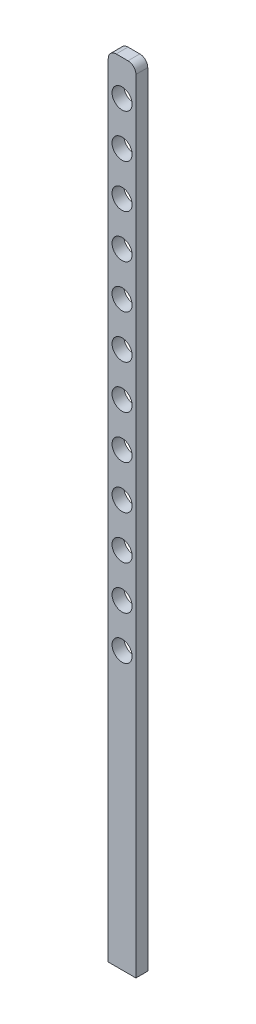
ISO-10303-21;
HEADER;
FILE_DESCRIPTION(('STEP AP214'),'2;1');
FILE_NAME('part.step','',(''),(''),'','','');
FILE_SCHEMA(('AUTOMOTIVE_DESIGN { 1 0 10303 214 1 1 1 1 }'));
ENDSEC;
DATA;
#1=APPLICATION_CONTEXT('core data for automotive mechanical design processes');
#2=APPLICATION_PROTOCOL_DEFINITION('international standard','automotive_design',2000,#1);
#3=PRODUCT_CONTEXT('',#1,'mechanical');
#4=PRODUCT('Part','Part','',(#3));
#5=PRODUCT_RELATED_PRODUCT_CATEGORY('part','',(#4));
#6=PRODUCT_DEFINITION_FORMATION('','',#4);
#7=PRODUCT_DEFINITION_CONTEXT('part definition',#1,'design');
#8=PRODUCT_DEFINITION('design','',#6,#7);
#9=PRODUCT_DEFINITION_SHAPE('','',#8);
#10=(LENGTH_UNIT() NAMED_UNIT(*) SI_UNIT(.MILLI.,.METRE.));
#11=(NAMED_UNIT(*) PLANE_ANGLE_UNIT() SI_UNIT($,.RADIAN.));
#12=(NAMED_UNIT(*) SI_UNIT($,.STERADIAN.) SOLID_ANGLE_UNIT());
#13=UNCERTAINTY_MEASURE_WITH_UNIT(LENGTH_MEASURE(1.E-05),#10,'distance_accuracy_value','');
#14=(GEOMETRIC_REPRESENTATION_CONTEXT(3) GLOBAL_UNCERTAINTY_ASSIGNED_CONTEXT((#13)) GLOBAL_UNIT_ASSIGNED_CONTEXT((#10,
#11,#12)) REPRESENTATION_CONTEXT('',''));
#15=CARTESIAN_POINT('',(0.,0.,0.));
#16=DIRECTION('',(0.,0.,1.));
#17=DIRECTION('',(1.,0.,0.));
#18=AXIS2_PLACEMENT_3D('',#15,#16,#17);
#19=CARTESIAN_POINT('',(0.,455.,-7.5));
#20=DIRECTION('',(0.,0.,1.));
#21=DIRECTION('',(1.,0.,0.));
#22=AXIS2_PLACEMENT_3D('',#19,#20,#21);
#23=CYLINDRICAL_SURFACE('',#22,12.7);
#24=CARTESIAN_POINT('',(0.,455.,-7.5));
#25=DIRECTION('',(0.,0.,1.));
#26=DIRECTION('',(1.,0.,0.));
#27=AXIS2_PLACEMENT_3D('',#24,#25,#26);
#28=CIRCLE('',#27,12.7);
#29=CARTESIAN_POINT('',(12.6999999999999,455.,-7.5));
#30=VERTEX_POINT('',#29);
#31=EDGE_CURVE('E215',#30,#30,#28,.T.);
#32=ORIENTED_EDGE('',*,*,#31,.F.);
#33=EDGE_LOOP('',(#32));
#34=FACE_BOUND('',#33,.T.);
#35=CARTESIAN_POINT('',(0.,455.,7.5));
#36=DIRECTION('',(0.,0.,1.));
#37=DIRECTION('',(1.,0.,0.));
#38=AXIS2_PLACEMENT_3D('',#35,#36,#37);
#39=CIRCLE('',#38,12.7);
#40=CARTESIAN_POINT('',(12.6999999999999,455.,7.5));
#41=VERTEX_POINT('',#40);
#42=EDGE_CURVE('E219',#41,#41,#39,.T.);
#43=ORIENTED_EDGE('',*,*,#42,.T.);
#44=EDGE_LOOP('',(#43));
#45=FACE_BOUND('',#44,.T.);
#46=ADVANCED_FACE('F45',(#34,#45),#23,.F.);
#47=CARTESIAN_POINT('',(0.,400.,-7.5));
#48=DIRECTION('',(0.,0.,1.));
#49=DIRECTION('',(1.,0.,0.));
#50=AXIS2_PLACEMENT_3D('',#47,#48,#49);
#51=CYLINDRICAL_SURFACE('',#50,12.7);
#52=CARTESIAN_POINT('',(0.,400.,-7.5));
#53=DIRECTION('',(0.,0.,1.));
#54=DIRECTION('',(1.,0.,0.));
#55=AXIS2_PLACEMENT_3D('',#52,#53,#54);
#56=CIRCLE('',#55,12.7);
#57=CARTESIAN_POINT('',(12.6999999999999,400.,-7.5));
#58=VERTEX_POINT('',#57);
#59=EDGE_CURVE('E207',#58,#58,#56,.T.);
#60=ORIENTED_EDGE('',*,*,#59,.F.);
#61=EDGE_LOOP('',(#60));
#62=FACE_BOUND('',#61,.T.);
#63=CARTESIAN_POINT('',(0.,400.,7.5));
#64=DIRECTION('',(0.,0.,1.));
#65=DIRECTION('',(1.,0.,0.));
#66=AXIS2_PLACEMENT_3D('',#63,#64,#65);
#67=CIRCLE('',#66,12.7);
#68=CARTESIAN_POINT('',(12.6999999999999,400.,7.5));
#69=VERTEX_POINT('',#68);
#70=EDGE_CURVE('E211',#69,#69,#67,.T.);
#71=ORIENTED_EDGE('',*,*,#70,.T.);
#72=EDGE_LOOP('',(#71));
#73=FACE_BOUND('',#72,.T.);
#74=ADVANCED_FACE('F297',(#62,#73),#51,.F.);
#75=CARTESIAN_POINT('',(0.,345.,-7.5));
#76=DIRECTION('',(0.,0.,1.));
#77=DIRECTION('',(1.,0.,0.));
#78=AXIS2_PLACEMENT_3D('',#75,#76,#77);
#79=CYLINDRICAL_SURFACE('',#78,12.7);
#80=CARTESIAN_POINT('',(0.,345.,-7.5));
#81=DIRECTION('',(0.,0.,1.));
#82=DIRECTION('',(1.,0.,0.));
#83=AXIS2_PLACEMENT_3D('',#80,#81,#82);
#84=CIRCLE('',#83,12.7);
#85=CARTESIAN_POINT('',(12.6999999999999,345.,-7.5));
#86=VERTEX_POINT('',#85);
#87=EDGE_CURVE('E199',#86,#86,#84,.T.);
#88=ORIENTED_EDGE('',*,*,#87,.F.);
#89=EDGE_LOOP('',(#88));
#90=FACE_BOUND('',#89,.T.);
#91=CARTESIAN_POINT('',(0.,345.,7.5));
#92=DIRECTION('',(0.,0.,1.));
#93=DIRECTION('',(1.,0.,0.));
#94=AXIS2_PLACEMENT_3D('',#91,#92,#93);
#95=CIRCLE('',#94,12.7);
#96=CARTESIAN_POINT('',(12.6999999999999,345.,7.5));
#97=VERTEX_POINT('',#96);
#98=EDGE_CURVE('E203',#97,#97,#95,.T.);
#99=ORIENTED_EDGE('',*,*,#98,.T.);
#100=EDGE_LOOP('',(#99));
#101=FACE_BOUND('',#100,.T.);
#102=ADVANCED_FACE('F303',(#90,#101),#79,.F.);
#103=CARTESIAN_POINT('',(0.,290.,-7.5));
#104=DIRECTION('',(0.,0.,1.));
#105=DIRECTION('',(1.,0.,0.));
#106=AXIS2_PLACEMENT_3D('',#103,#104,#105);
#107=CYLINDRICAL_SURFACE('',#106,12.7);
#108=CARTESIAN_POINT('',(0.,290.,-7.5));
#109=DIRECTION('',(0.,0.,1.));
#110=DIRECTION('',(1.,0.,0.));
#111=AXIS2_PLACEMENT_3D('',#108,#109,#110);
#112=CIRCLE('',#111,12.7);
#113=CARTESIAN_POINT('',(12.6999999999999,290.,-7.5));
#114=VERTEX_POINT('',#113);
#115=EDGE_CURVE('E191',#114,#114,#112,.T.);
#116=ORIENTED_EDGE('',*,*,#115,.F.);
#117=EDGE_LOOP('',(#116));
#118=FACE_BOUND('',#117,.T.);
#119=CARTESIAN_POINT('',(0.,290.,7.5));
#120=DIRECTION('',(0.,0.,1.));
#121=DIRECTION('',(1.,0.,0.));
#122=AXIS2_PLACEMENT_3D('',#119,#120,#121);
#123=CIRCLE('',#122,12.7);
#124=CARTESIAN_POINT('',(12.6999999999999,290.,7.5));
#125=VERTEX_POINT('',#124);
#126=EDGE_CURVE('E195',#125,#125,#123,.T.);
#127=ORIENTED_EDGE('',*,*,#126,.T.);
#128=EDGE_LOOP('',(#127));
#129=FACE_BOUND('',#128,.T.);
#130=ADVANCED_FACE('F435',(#118,#129),#107,.F.);
#131=CARTESIAN_POINT('',(0.,235.,-7.5));
#132=DIRECTION('',(0.,0.,1.));
#133=DIRECTION('',(1.,0.,0.));
#134=AXIS2_PLACEMENT_3D('',#131,#132,#133);
#135=CYLINDRICAL_SURFACE('',#134,12.7);
#136=CARTESIAN_POINT('',(0.,235.,-7.5));
#137=DIRECTION('',(0.,0.,1.));
#138=DIRECTION('',(1.,0.,0.));
#139=AXIS2_PLACEMENT_3D('',#136,#137,#138);
#140=CIRCLE('',#139,12.7);
#141=CARTESIAN_POINT('',(12.6999999999999,235.,-7.5));
#142=VERTEX_POINT('',#141);
#143=EDGE_CURVE('E183',#142,#142,#140,.T.);
#144=ORIENTED_EDGE('',*,*,#143,.F.);
#145=EDGE_LOOP('',(#144));
#146=FACE_BOUND('',#145,.T.);
#147=CARTESIAN_POINT('',(0.,235.,7.5));
#148=DIRECTION('',(0.,0.,1.));
#149=DIRECTION('',(1.,0.,0.));
#150=AXIS2_PLACEMENT_3D('',#147,#148,#149);
#151=CIRCLE('',#150,12.7);
#152=CARTESIAN_POINT('',(12.6999999999999,235.,7.5));
#153=VERTEX_POINT('',#152);
#154=EDGE_CURVE('E187',#153,#153,#151,.T.);
#155=ORIENTED_EDGE('',*,*,#154,.T.);
#156=EDGE_LOOP('',(#155));
#157=FACE_BOUND('',#156,.T.);
#158=ADVANCED_FACE('F425',(#146,#157),#135,.F.);
#159=CARTESIAN_POINT('',(0.,180.,-7.5));
#160=DIRECTION('',(0.,0.,1.));
#161=DIRECTION('',(1.,0.,0.));
#162=AXIS2_PLACEMENT_3D('',#159,#160,#161);
#163=CYLINDRICAL_SURFACE('',#162,12.7);
#164=CARTESIAN_POINT('',(0.,180.,-7.5));
#165=DIRECTION('',(0.,0.,1.));
#166=DIRECTION('',(1.,0.,0.));
#167=AXIS2_PLACEMENT_3D('',#164,#165,#166);
#168=CIRCLE('',#167,12.7);
#169=CARTESIAN_POINT('',(12.7,180.,-7.5));
#170=VERTEX_POINT('',#169);
#171=EDGE_CURVE('E175',#170,#170,#168,.T.);
#172=ORIENTED_EDGE('',*,*,#171,.F.);
#173=EDGE_LOOP('',(#172));
#174=FACE_BOUND('',#173,.T.);
#175=CARTESIAN_POINT('',(0.,180.,7.5));
#176=DIRECTION('',(0.,0.,1.));
#177=DIRECTION('',(1.,0.,0.));
#178=AXIS2_PLACEMENT_3D('',#175,#176,#177);
#179=CIRCLE('',#178,12.7);
#180=CARTESIAN_POINT('',(12.7,180.,7.5));
#181=VERTEX_POINT('',#180);
#182=EDGE_CURVE('E179',#181,#181,#179,.T.);
#183=ORIENTED_EDGE('',*,*,#182,.T.);
#184=EDGE_LOOP('',(#183));
#185=FACE_BOUND('',#184,.T.);
#186=ADVANCED_FACE('F415',(#174,#185),#163,.F.);
#187=CARTESIAN_POINT('',(0.,125.,-7.5));
#188=DIRECTION('',(0.,0.,1.));
#189=DIRECTION('',(1.,0.,0.));
#190=AXIS2_PLACEMENT_3D('',#187,#188,#189);
#191=CYLINDRICAL_SURFACE('',#190,12.7);
#192=CARTESIAN_POINT('',(0.,125.,-7.5));
#193=DIRECTION('',(0.,0.,1.));
#194=DIRECTION('',(1.,0.,0.));
#195=AXIS2_PLACEMENT_3D('',#192,#193,#194);
#196=CIRCLE('',#195,12.7);
#197=CARTESIAN_POINT('',(12.7,125.,-7.5));
#198=VERTEX_POINT('',#197);
#199=EDGE_CURVE('E167',#198,#198,#196,.T.);
#200=ORIENTED_EDGE('',*,*,#199,.F.);
#201=EDGE_LOOP('',(#200));
#202=FACE_BOUND('',#201,.T.);
#203=CARTESIAN_POINT('',(0.,125.,7.5));
#204=DIRECTION('',(0.,0.,1.));
#205=DIRECTION('',(1.,0.,0.));
#206=AXIS2_PLACEMENT_3D('',#203,#204,#205);
#207=CIRCLE('',#206,12.7);
#208=CARTESIAN_POINT('',(12.7,125.,7.5));
#209=VERTEX_POINT('',#208);
#210=EDGE_CURVE('E171',#209,#209,#207,.T.);
#211=ORIENTED_EDGE('',*,*,#210,.T.);
#212=EDGE_LOOP('',(#211));
#213=FACE_BOUND('',#212,.T.);
#214=ADVANCED_FACE('F405',(#202,#213),#191,.F.);
#215=CARTESIAN_POINT('',(0.,70.,-7.5));
#216=DIRECTION('',(0.,0.,1.));
#217=DIRECTION('',(1.,0.,0.));
#218=AXIS2_PLACEMENT_3D('',#215,#216,#217);
#219=CYLINDRICAL_SURFACE('',#218,12.7);
#220=CARTESIAN_POINT('',(0.,70.,-7.5));
#221=DIRECTION('',(0.,0.,1.));
#222=DIRECTION('',(1.,0.,0.));
#223=AXIS2_PLACEMENT_3D('',#220,#221,#222);
#224=CIRCLE('',#223,12.7);
#225=CARTESIAN_POINT('',(12.7,70.,-7.5));
#226=VERTEX_POINT('',#225);
#227=EDGE_CURVE('E159',#226,#226,#224,.T.);
#228=ORIENTED_EDGE('',*,*,#227,.F.);
#229=EDGE_LOOP('',(#228));
#230=FACE_BOUND('',#229,.T.);
#231=CARTESIAN_POINT('',(0.,70.,7.5));
#232=DIRECTION('',(0.,0.,1.));
#233=DIRECTION('',(1.,0.,0.));
#234=AXIS2_PLACEMENT_3D('',#231,#232,#233);
#235=CIRCLE('',#234,12.7);
#236=CARTESIAN_POINT('',(12.7,70.,7.5));
#237=VERTEX_POINT('',#236);
#238=EDGE_CURVE('E163',#237,#237,#235,.T.);
#239=ORIENTED_EDGE('',*,*,#238,.T.);
#240=EDGE_LOOP('',(#239));
#241=FACE_BOUND('',#240,.T.);
#242=ADVANCED_FACE('F395',(#230,#241),#219,.F.);
#243=CARTESIAN_POINT('',(0.,15.,-7.5));
#244=DIRECTION('',(0.,0.,1.));
#245=DIRECTION('',(1.,0.,0.));
#246=AXIS2_PLACEMENT_3D('',#243,#244,#245);
#247=CYLINDRICAL_SURFACE('',#246,12.7);
#248=CARTESIAN_POINT('',(0.,15.,-7.5));
#249=DIRECTION('',(0.,0.,1.));
#250=DIRECTION('',(1.,0.,0.));
#251=AXIS2_PLACEMENT_3D('',#248,#249,#250);
#252=CIRCLE('',#251,12.7);
#253=CARTESIAN_POINT('',(12.7,15.,-7.5));
#254=VERTEX_POINT('',#253);
#255=EDGE_CURVE('E151',#254,#254,#252,.T.);
#256=ORIENTED_EDGE('',*,*,#255,.F.);
#257=EDGE_LOOP('',(#256));
#258=FACE_BOUND('',#257,.T.);
#259=CARTESIAN_POINT('',(0.,15.,7.5));
#260=DIRECTION('',(0.,0.,1.));
#261=DIRECTION('',(1.,0.,0.));
#262=AXIS2_PLACEMENT_3D('',#259,#260,#261);
#263=CIRCLE('',#262,12.7);
#264=CARTESIAN_POINT('',(12.7,15.,7.5));
#265=VERTEX_POINT('',#264);
#266=EDGE_CURVE('E155',#265,#265,#263,.T.);
#267=ORIENTED_EDGE('',*,*,#266,.T.);
#268=EDGE_LOOP('',(#267));
#269=FACE_BOUND('',#268,.T.);
#270=ADVANCED_FACE('F385',(#258,#269),#247,.F.);
#271=CARTESIAN_POINT('',(0.,-40.,-7.5));
#272=DIRECTION('',(0.,0.,1.));
#273=DIRECTION('',(1.,0.,0.));
#274=AXIS2_PLACEMENT_3D('',#271,#272,#273);
#275=CYLINDRICAL_SURFACE('',#274,12.7);
#276=CARTESIAN_POINT('',(0.,-40.,-7.5));
#277=DIRECTION('',(0.,0.,1.));
#278=DIRECTION('',(1.,0.,0.));
#279=AXIS2_PLACEMENT_3D('',#276,#277,#278);
#280=CIRCLE('',#279,12.7);
#281=CARTESIAN_POINT('',(12.7,-40.,-7.5));
#282=VERTEX_POINT('',#281);
#283=EDGE_CURVE('E119',#282,#282,#280,.T.);
#284=ORIENTED_EDGE('',*,*,#283,.F.);
#285=EDGE_LOOP('',(#284));
#286=FACE_BOUND('',#285,.T.);
#287=CARTESIAN_POINT('',(0.,-40.,7.5));
#288=DIRECTION('',(0.,0.,1.));
#289=DIRECTION('',(1.,0.,0.));
#290=AXIS2_PLACEMENT_3D('',#287,#288,#289);
#291=CIRCLE('',#290,12.7);
#292=CARTESIAN_POINT('',(12.7,-40.,7.5));
#293=VERTEX_POINT('',#292);
#294=EDGE_CURVE('E147',#293,#293,#291,.T.);
#295=ORIENTED_EDGE('',*,*,#294,.T.);
#296=EDGE_LOOP('',(#295));
#297=FACE_BOUND('',#296,.T.);
#298=ADVANCED_FACE('F377',(#286,#297),#275,.F.);
#299=CARTESIAN_POINT('',(17.4999999999999,500.,7.5));
#300=DIRECTION('',(-1.,0.,0.));
#301=DIRECTION('',(0.,-1.,0.));
#302=AXIS2_PLACEMENT_3D('',#299,#300,#301);
#303=PLANE('',#302);
#304=DIRECTION('',(0.,1.,0.));
#305=VECTOR('',#304,1.);
#306=CARTESIAN_POINT('',(17.4999999999999,500.,-7.5));
#307=LINE('',#306,#305);
#308=CARTESIAN_POINT('',(17.5000000000001,-500.,-7.5));
#309=VERTEX_POINT('',#308);
#310=CARTESIAN_POINT('',(17.4999999999999,490.,-7.5));
#311=VERTEX_POINT('',#310);
#312=EDGE_CURVE('E130',#309,#311,#307,.T.);
#313=ORIENTED_EDGE('',*,*,#312,.T.);
#314=DIRECTION('',(0.,0.,-1.));
#315=VECTOR('',#314,1.);
#316=CARTESIAN_POINT('',(17.4999999999999,490.,7.5));
#317=LINE('',#316,#315);
#318=CARTESIAN_POINT('',(17.4999999999999,490.,7.5));
#319=VERTEX_POINT('',#318);
#320=EDGE_CURVE('E69',#311,#319,#317,.F.);
#321=ORIENTED_EDGE('',*,*,#320,.T.);
#322=DIRECTION('',(0.,1.,0.));
#323=VECTOR('',#322,1.);
#324=CARTESIAN_POINT('',(17.4999999999999,500.,7.5));
#325=LINE('',#324,#323);
#326=CARTESIAN_POINT('',(17.5000000000001,-500.,7.5));
#327=VERTEX_POINT('',#326);
#328=EDGE_CURVE('E142',#327,#319,#325,.T.);
#329=ORIENTED_EDGE('',*,*,#328,.F.);
#330=DIRECTION('',(0.,0.,-1.));
#331=VECTOR('',#330,1.);
#332=CARTESIAN_POINT('',(17.5000000000001,-500.,7.5));
#333=LINE('',#332,#331);
#334=EDGE_CURVE('E120',#327,#309,#333,.T.);
#335=ORIENTED_EDGE('',*,*,#334,.T.);
#336=EDGE_LOOP('',(#313,#321,#329,#335));
#337=FACE_BOUND('',#336,.T.);
#338=ADVANCED_FACE('F254',(#337),#303,.F.);
#339=CARTESIAN_POINT('',(-17.5000000000001,500.,7.5));
#340=DIRECTION('',(0.,-1.,0.));
#341=DIRECTION('',(0.,0.,-1.));
#342=AXIS2_PLACEMENT_3D('',#339,#340,#341);
#343=PLANE('',#342);
#344=DIRECTION('',(-1.,0.,0.));
#345=VECTOR('',#344,1.);
#346=CARTESIAN_POINT('',(-17.5000000000001,500.,7.5));
#347=LINE('',#346,#345);
#348=CARTESIAN_POINT('',(7.49999999999994,500.,7.5));
#349=VERTEX_POINT('',#348);
#350=CARTESIAN_POINT('',(-7.50000000000006,500.,7.5));
#351=VERTEX_POINT('',#350);
#352=EDGE_CURVE('E109',#349,#351,#347,.T.);
#353=ORIENTED_EDGE('',*,*,#352,.F.);
#354=DIRECTION('',(0.,0.,-1.));
#355=VECTOR('',#354,1.);
#356=CARTESIAN_POINT('',(7.49999999999994,500.,7.5));
#357=LINE('',#356,#355);
#358=CARTESIAN_POINT('',(7.49999999999994,500.,-7.5));
#359=VERTEX_POINT('',#358);
#360=EDGE_CURVE('E226',#349,#359,#357,.T.);
#361=ORIENTED_EDGE('',*,*,#360,.T.);
#362=DIRECTION('',(-1.,0.,0.));
#363=VECTOR('',#362,1.);
#364=CARTESIAN_POINT('',(-17.5000000000001,500.,-7.5));
#365=LINE('',#364,#363);
#366=CARTESIAN_POINT('',(-7.50000000000006,500.,-7.5));
#367=VERTEX_POINT('',#366);
#368=EDGE_CURVE('E133',#359,#367,#365,.T.);
#369=ORIENTED_EDGE('',*,*,#368,.T.);
#370=DIRECTION('',(0.,0.,-1.));
#371=VECTOR('',#370,1.);
#372=CARTESIAN_POINT('',(-7.50000000000006,500.,7.5));
#373=LINE('',#372,#371);
#374=EDGE_CURVE('E223',#367,#351,#373,.F.);
#375=ORIENTED_EDGE('',*,*,#374,.T.);
#376=EDGE_LOOP('',(#353,#361,#369,#375));
#377=FACE_BOUND('',#376,.T.);
#378=ADVANCED_FACE('F245',(#377),#343,.F.);
#379=CARTESIAN_POINT('',(-17.5000000000001,500.,7.5));
#380=DIRECTION('',(1.,0.,0.));
#381=DIRECTION('',(0.,1.,0.));
#382=AXIS2_PLACEMENT_3D('',#379,#380,#381);
#383=PLANE('',#382);
#384=DIRECTION('',(0.,-1.,0.));
#385=VECTOR('',#384,1.);
#386=CARTESIAN_POINT('',(-17.5000000000001,500.,7.5));
#387=LINE('',#386,#385);
#388=CARTESIAN_POINT('',(-17.5000000000001,490.,7.5));
#389=VERTEX_POINT('',#388);
#390=CARTESIAN_POINT('',(-17.4999999999999,-500.,7.5));
#391=VERTEX_POINT('',#390);
#392=EDGE_CURVE('E99',#389,#391,#387,.T.);
#393=ORIENTED_EDGE('',*,*,#392,.F.);
#394=DIRECTION('',(0.,0.,-1.));
#395=VECTOR('',#394,1.);
#396=CARTESIAN_POINT('',(-17.5000000000001,490.,7.5));
#397=LINE('',#396,#395);
#398=CARTESIAN_POINT('',(-17.5000000000001,490.,-7.5));
#399=VERTEX_POINT('',#398);
#400=EDGE_CURVE('E11',#389,#399,#397,.T.);
#401=ORIENTED_EDGE('',*,*,#400,.T.);
#402=DIRECTION('',(0.,-1.,0.));
#403=VECTOR('',#402,1.);
#404=CARTESIAN_POINT('',(-17.5000000000001,500.,-7.5));
#405=LINE('',#404,#403);
#406=CARTESIAN_POINT('',(-17.4999999999999,-500.,-7.5));
#407=VERTEX_POINT('',#406);
#408=EDGE_CURVE('E115',#399,#407,#405,.T.);
#409=ORIENTED_EDGE('',*,*,#408,.T.);
#410=DIRECTION('',(0.,0.,-1.));
#411=VECTOR('',#410,1.);
#412=CARTESIAN_POINT('',(-17.4999999999999,-500.,7.5));
#413=LINE('',#412,#411);
#414=EDGE_CURVE('E112',#391,#407,#413,.T.);
#415=ORIENTED_EDGE('',*,*,#414,.F.);
#416=EDGE_LOOP('',(#393,#401,#409,#415));
#417=FACE_BOUND('',#416,.T.);
#418=ADVANCED_FACE('F113',(#417),#383,.F.);
#419=CARTESIAN_POINT('',(-17.4999999999999,-500.,7.5));
#420=DIRECTION('',(0.,1.,0.));
#421=DIRECTION('',(0.,0.,1.));
#422=AXIS2_PLACEMENT_3D('',#419,#420,#421);
#423=PLANE('',#422);
#424=DIRECTION('',(1.,0.,0.));
#425=VECTOR('',#424,1.);
#426=CARTESIAN_POINT('',(-17.4999999999999,-500.,-7.5));
#427=LINE('',#426,#425);
#428=EDGE_CURVE('E140',#407,#309,#427,.T.);
#429=ORIENTED_EDGE('',*,*,#428,.T.);
#430=ORIENTED_EDGE('',*,*,#334,.F.);
#431=DIRECTION('',(1.,0.,0.));
#432=VECTOR('',#431,1.);
#433=CARTESIAN_POINT('',(-17.4999999999999,-500.,7.5));
#434=LINE('',#433,#432);
#435=EDGE_CURVE('E104',#391,#327,#434,.T.);
#436=ORIENTED_EDGE('',*,*,#435,.F.);
#437=ORIENTED_EDGE('',*,*,#414,.T.);
#438=EDGE_LOOP('',(#429,#430,#436,#437));
#439=FACE_BOUND('',#438,.T.);
#440=ADVANCED_FACE('F122',(#439),#423,.F.);
#441=CARTESIAN_POINT('',(0.,0.,7.5));
#442=DIRECTION('',(0.,0.,1.));
#443=DIRECTION('',(1.,0.,0.));
#444=AXIS2_PLACEMENT_3D('',#441,#442,#443);
#445=PLANE('',#444);
#446=CARTESIAN_POINT('',(0.,-95.,7.5));
#447=DIRECTION('',(0.,0.,1.));
#448=DIRECTION('',(1.,0.,0.));
#449=AXIS2_PLACEMENT_3D('',#446,#447,#448);
#450=CIRCLE('',#449,12.7);
#451=CARTESIAN_POINT('',(12.7,-95.,7.5));
#452=VERTEX_POINT('',#451);
#453=EDGE_CURVE('E265',#452,#452,#450,.T.);
#454=ORIENTED_EDGE('',*,*,#453,.F.);
#455=EDGE_LOOP('',(#454));
#456=FACE_BOUND('',#455,.T.);
#457=CARTESIAN_POINT('',(0.,-150.,7.5));
#458=DIRECTION('',(0.,0.,1.));
#459=DIRECTION('',(1.,0.,0.));
#460=AXIS2_PLACEMENT_3D('',#457,#458,#459);
#461=CIRCLE('',#460,12.7);
#462=CARTESIAN_POINT('',(12.7,-150.,7.5));
#463=VERTEX_POINT('',#462);
#464=EDGE_CURVE('E261',#463,#463,#461,.T.);
#465=ORIENTED_EDGE('',*,*,#464,.F.);
#466=EDGE_LOOP('',(#465));
#467=FACE_BOUND('',#466,.T.);
#468=ORIENTED_EDGE('',*,*,#328,.T.);
#469=CARTESIAN_POINT('',(7.49999999999994,490.,7.5));
#470=DIRECTION('',(0.,0.,1.));
#471=DIRECTION('',(1.,0.,0.));
#472=AXIS2_PLACEMENT_3D('',#469,#470,#471);
#473=CIRCLE('',#472,10.);
#474=EDGE_CURVE('E54',#319,#349,#473,.T.);
#475=ORIENTED_EDGE('',*,*,#474,.T.);
#476=ORIENTED_EDGE('',*,*,#352,.T.);
#477=CARTESIAN_POINT('',(-7.50000000000006,490.,7.5));
#478=DIRECTION('',(0.,0.,1.));
#479=DIRECTION('',(1.,0.,0.));
#480=AXIS2_PLACEMENT_3D('',#477,#478,#479);
#481=CIRCLE('',#480,10.);
#482=EDGE_CURVE('E61',#351,#389,#481,.T.);
#483=ORIENTED_EDGE('',*,*,#482,.T.);
#484=ORIENTED_EDGE('',*,*,#392,.T.);
#485=ORIENTED_EDGE('',*,*,#435,.T.);
#486=EDGE_LOOP('',(#468,#475,#476,#483,#484,#485));
#487=FACE_BOUND('',#486,.T.);
#488=ORIENTED_EDGE('',*,*,#294,.F.);
#489=EDGE_LOOP('',(#488));
#490=FACE_BOUND('',#489,.T.);
#491=ORIENTED_EDGE('',*,*,#266,.F.);
#492=EDGE_LOOP('',(#491));
#493=FACE_BOUND('',#492,.T.);
#494=ORIENTED_EDGE('',*,*,#238,.F.);
#495=EDGE_LOOP('',(#494));
#496=FACE_BOUND('',#495,.T.);
#497=ORIENTED_EDGE('',*,*,#210,.F.);
#498=EDGE_LOOP('',(#497));
#499=FACE_BOUND('',#498,.T.);
#500=ORIENTED_EDGE('',*,*,#182,.F.);
#501=EDGE_LOOP('',(#500));
#502=FACE_BOUND('',#501,.T.);
#503=ORIENTED_EDGE('',*,*,#154,.F.);
#504=EDGE_LOOP('',(#503));
#505=FACE_BOUND('',#504,.T.);
#506=ORIENTED_EDGE('',*,*,#126,.F.);
#507=EDGE_LOOP('',(#506));
#508=FACE_BOUND('',#507,.T.);
#509=ORIENTED_EDGE('',*,*,#98,.F.);
#510=EDGE_LOOP('',(#509));
#511=FACE_BOUND('',#510,.T.);
#512=ORIENTED_EDGE('',*,*,#70,.F.);
#513=EDGE_LOOP('',(#512));
#514=FACE_BOUND('',#513,.T.);
#515=ORIENTED_EDGE('',*,*,#42,.F.);
#516=EDGE_LOOP('',(#515));
#517=FACE_BOUND('',#516,.T.);
#518=ADVANCED_FACE('F101',(#456,#467,#487,#490,#493,#496,#499,#502,#505,#508,#511,#514,#517),
#445,.T.);
#519=CARTESIAN_POINT('',(0.,0.,-7.5));
#520=DIRECTION('',(0.,0.,1.));
#521=DIRECTION('',(1.,0.,0.));
#522=AXIS2_PLACEMENT_3D('',#519,#520,#521);
#523=PLANE('',#522);
#524=CARTESIAN_POINT('',(0.,-95.,-7.5));
#525=DIRECTION('',(0.,0.,1.));
#526=DIRECTION('',(1.,0.,0.));
#527=AXIS2_PLACEMENT_3D('',#524,#525,#526);
#528=CIRCLE('',#527,12.7);
#529=CARTESIAN_POINT('',(12.7,-95.,-7.5));
#530=VERTEX_POINT('',#529);
#531=EDGE_CURVE('E269',#530,#530,#528,.T.);
#532=ORIENTED_EDGE('',*,*,#531,.T.);
#533=EDGE_LOOP('',(#532));
#534=FACE_BOUND('',#533,.T.);
#535=CARTESIAN_POINT('',(0.,-150.,-7.5));
#536=DIRECTION('',(0.,0.,1.));
#537=DIRECTION('',(1.,0.,0.));
#538=AXIS2_PLACEMENT_3D('',#535,#536,#537);
#539=CIRCLE('',#538,12.7);
#540=CARTESIAN_POINT('',(12.7,-150.,-7.5));
#541=VERTEX_POINT('',#540);
#542=EDGE_CURVE('E134',#541,#541,#539,.T.);
#543=ORIENTED_EDGE('',*,*,#542,.T.);
#544=EDGE_LOOP('',(#543));
#545=FACE_BOUND('',#544,.T.);
#546=ORIENTED_EDGE('',*,*,#368,.F.);
#547=CARTESIAN_POINT('',(7.49999999999994,490.,-7.5));
#548=DIRECTION('',(0.,0.,1.));
#549=DIRECTION('',(1.,0.,0.));
#550=AXIS2_PLACEMENT_3D('',#547,#548,#549);
#551=CIRCLE('',#550,10.);
#552=EDGE_CURVE('E233',#359,#311,#551,.F.);
#553=ORIENTED_EDGE('',*,*,#552,.T.);
#554=ORIENTED_EDGE('',*,*,#312,.F.);
#555=ORIENTED_EDGE('',*,*,#428,.F.);
#556=ORIENTED_EDGE('',*,*,#408,.F.);
#557=CARTESIAN_POINT('',(-7.50000000000006,490.,-7.5));
#558=DIRECTION('',(0.,0.,1.));
#559=DIRECTION('',(1.,0.,0.));
#560=AXIS2_PLACEMENT_3D('',#557,#558,#559);
#561=CIRCLE('',#560,10.);
#562=EDGE_CURVE('E230',#399,#367,#561,.F.);
#563=ORIENTED_EDGE('',*,*,#562,.T.);
#564=EDGE_LOOP('',(#546,#553,#554,#555,#556,#563));
#565=FACE_BOUND('',#564,.T.);
#566=ORIENTED_EDGE('',*,*,#283,.T.);
#567=EDGE_LOOP('',(#566));
#568=FACE_BOUND('',#567,.T.);
#569=ORIENTED_EDGE('',*,*,#255,.T.);
#570=EDGE_LOOP('',(#569));
#571=FACE_BOUND('',#570,.T.);
#572=ORIENTED_EDGE('',*,*,#227,.T.);
#573=EDGE_LOOP('',(#572));
#574=FACE_BOUND('',#573,.T.);
#575=ORIENTED_EDGE('',*,*,#199,.T.);
#576=EDGE_LOOP('',(#575));
#577=FACE_BOUND('',#576,.T.);
#578=ORIENTED_EDGE('',*,*,#171,.T.);
#579=EDGE_LOOP('',(#578));
#580=FACE_BOUND('',#579,.T.);
#581=ORIENTED_EDGE('',*,*,#143,.T.);
#582=EDGE_LOOP('',(#581));
#583=FACE_BOUND('',#582,.T.);
#584=ORIENTED_EDGE('',*,*,#115,.T.);
#585=EDGE_LOOP('',(#584));
#586=FACE_BOUND('',#585,.T.);
#587=ORIENTED_EDGE('',*,*,#87,.T.);
#588=EDGE_LOOP('',(#587));
#589=FACE_BOUND('',#588,.T.);
#590=ORIENTED_EDGE('',*,*,#59,.T.);
#591=EDGE_LOOP('',(#590));
#592=FACE_BOUND('',#591,.T.);
#593=ORIENTED_EDGE('',*,*,#31,.T.);
#594=EDGE_LOOP('',(#593));
#595=FACE_BOUND('',#594,.T.);
#596=ADVANCED_FACE('F252',(#534,#545,#565,#568,#571,#574,#577,#580,#583,#586,#589,#592,#595),
#523,.F.);
#597=CARTESIAN_POINT('',(0.,-150.,-7.5));
#598=DIRECTION('',(0.,0.,1.));
#599=DIRECTION('',(1.,0.,0.));
#600=AXIS2_PLACEMENT_3D('',#597,#598,#599);
#601=CYLINDRICAL_SURFACE('',#600,12.7);
#602=ORIENTED_EDGE('',*,*,#542,.F.);
#603=EDGE_LOOP('',(#602));
#604=FACE_BOUND('',#603,.T.);
#605=ORIENTED_EDGE('',*,*,#464,.T.);
#606=EDGE_LOOP('',(#605));
#607=FACE_BOUND('',#606,.T.);
#608=ADVANCED_FACE('F279',(#604,#607),#601,.F.);
#609=CARTESIAN_POINT('',(0.,-95.,-7.5));
#610=DIRECTION('',(0.,0.,1.));
#611=DIRECTION('',(1.,0.,0.));
#612=AXIS2_PLACEMENT_3D('',#609,#610,#611);
#613=CYLINDRICAL_SURFACE('',#612,12.7);
#614=ORIENTED_EDGE('',*,*,#531,.F.);
#615=EDGE_LOOP('',(#614));
#616=FACE_BOUND('',#615,.T.);
#617=ORIENTED_EDGE('',*,*,#453,.T.);
#618=EDGE_LOOP('',(#617));
#619=FACE_BOUND('',#618,.T.);
#620=ADVANCED_FACE('F276',(#616,#619),#613,.F.);
#621=CARTESIAN_POINT('',(7.49999999999994,490.,7.5));
#622=DIRECTION('',(0.,0.,-1.));
#623=DIRECTION('',(-1.,0.,0.));
#624=AXIS2_PLACEMENT_3D('',#621,#622,#623);
#625=CYLINDRICAL_SURFACE('',#624,10.);
#626=ORIENTED_EDGE('',*,*,#474,.F.);
#627=ORIENTED_EDGE('',*,*,#320,.F.);
#628=ORIENTED_EDGE('',*,*,#552,.F.);
#629=ORIENTED_EDGE('',*,*,#360,.F.);
#630=EDGE_LOOP('',(#626,#627,#628,#629));
#631=FACE_BOUND('',#630,.T.);
#632=ADVANCED_FACE('F249',(#631),#625,.T.);
#633=CARTESIAN_POINT('',(-7.50000000000006,490.,7.5));
#634=DIRECTION('',(0.,0.,-1.));
#635=DIRECTION('',(-1.,0.,0.));
#636=AXIS2_PLACEMENT_3D('',#633,#634,#635);
#637=CYLINDRICAL_SURFACE('',#636,10.);
#638=ORIENTED_EDGE('',*,*,#482,.F.);
#639=ORIENTED_EDGE('',*,*,#374,.F.);
#640=ORIENTED_EDGE('',*,*,#562,.F.);
#641=ORIENTED_EDGE('',*,*,#400,.F.);
#642=EDGE_LOOP('',(#638,#639,#640,#641));
#643=FACE_BOUND('',#642,.T.);
#644=ADVANCED_FACE('F47',(#643),#637,.T.);
#645=CLOSED_SHELL('',(#46,#74,#102,#130,#158,#186,#214,#242,#270,#298,#338,#378,#418,#440,#518,
#596,#608,#620,#632,#644));
#646=MANIFOLD_SOLID_BREP('B2',#645);
#647=ADVANCED_BREP_SHAPE_REPRESENTATION('',(#18,#646),#14);
#648=SHAPE_DEFINITION_REPRESENTATION(#9,#647);
ENDSEC;
END-ISO-10303-21;
